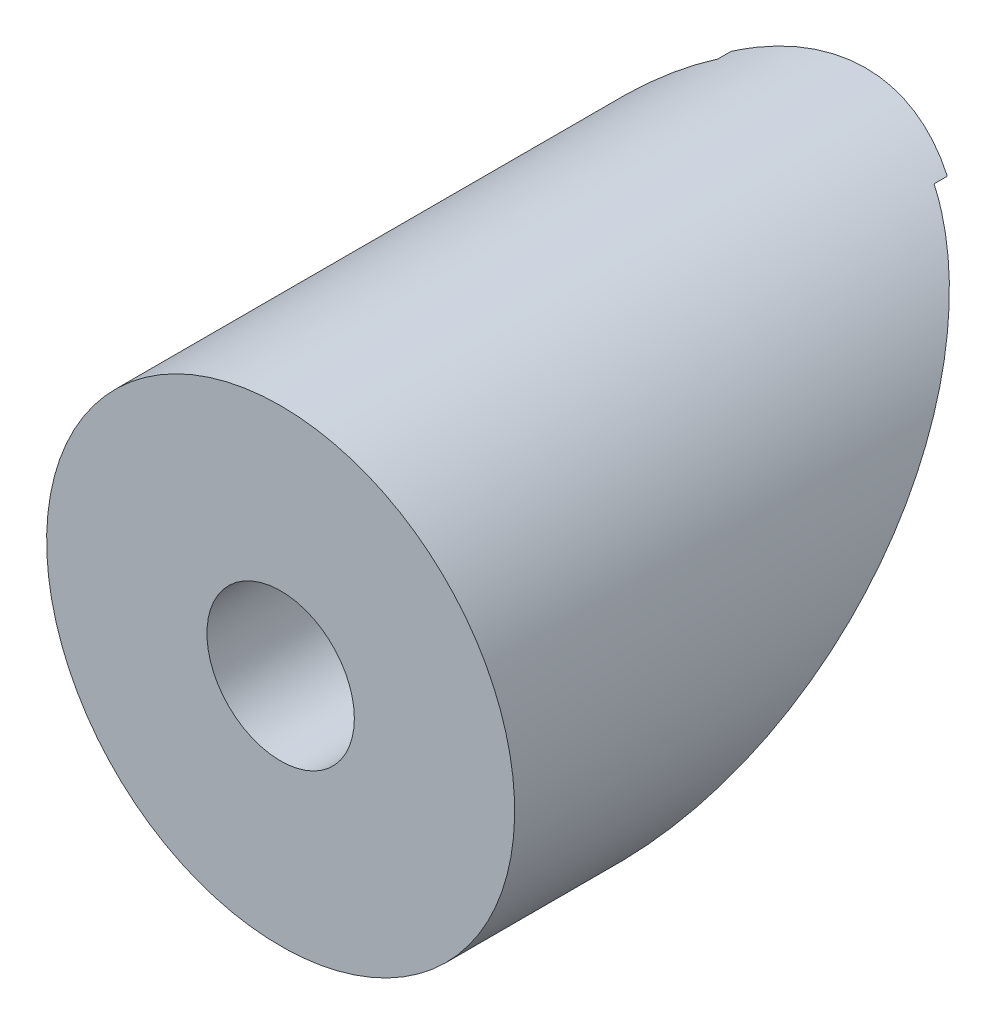
ISO-10303-21;
HEADER;
FILE_DESCRIPTION(('STEP AP214'),'2;1');
FILE_NAME('part.step','',(''),(''),'','','');
FILE_SCHEMA(('AUTOMOTIVE_DESIGN { 1 0 10303 214 1 1 1 1 }'));
ENDSEC;
DATA;
#1=APPLICATION_CONTEXT('core data for automotive mechanical design processes');
#2=APPLICATION_PROTOCOL_DEFINITION('international standard','automotive_design',2000,#1);
#3=PRODUCT_CONTEXT('',#1,'mechanical');
#4=PRODUCT('Part','Part','',(#3));
#5=PRODUCT_RELATED_PRODUCT_CATEGORY('part','',(#4));
#6=PRODUCT_DEFINITION_FORMATION('','',#4);
#7=PRODUCT_DEFINITION_CONTEXT('part definition',#1,'design');
#8=PRODUCT_DEFINITION('design','',#6,#7);
#9=PRODUCT_DEFINITION_SHAPE('','',#8);
#10=(LENGTH_UNIT() NAMED_UNIT(*) SI_UNIT(.MILLI.,.METRE.));
#11=(NAMED_UNIT(*) PLANE_ANGLE_UNIT() SI_UNIT($,.RADIAN.));
#12=(NAMED_UNIT(*) SI_UNIT($,.STERADIAN.) SOLID_ANGLE_UNIT());
#13=UNCERTAINTY_MEASURE_WITH_UNIT(LENGTH_MEASURE(1.E-05),#10,'distance_accuracy_value','');
#14=(GEOMETRIC_REPRESENTATION_CONTEXT(3) GLOBAL_UNCERTAINTY_ASSIGNED_CONTEXT((#13)) GLOBAL_UNIT_ASSIGNED_CONTEXT((#10,
#11,#12)) REPRESENTATION_CONTEXT('',''));
#15=CARTESIAN_POINT('',(0.,0.,0.));
#16=DIRECTION('',(0.,0.,1.));
#17=DIRECTION('',(1.,0.,0.));
#18=AXIS2_PLACEMENT_3D('',#15,#16,#17);
#19=CARTESIAN_POINT('',(9.525,9.525,-19.0500000000002));
#20=DIRECTION('',(0.,0.707106781186551,0.707106781186544));
#21=DIRECTION('',(0.,-0.707106781186544,0.707106781186551));
#22=AXIS2_PLACEMENT_3D('',#19,#20,#21);
#23=PLANE('',#22);
#24=CARTESIAN_POINT('',(0.,0.,-9.5250000000001));
#25=DIRECTION('',(0.,0.707106781186551,0.707106781186544));
#26=DIRECTION('',(0.,0.707106781186544,-0.707106781186551));
#27=AXIS2_PLACEMENT_3D('',#24,#25,#26);
#28=ELLIPSE('',#27,8.9802561210692,6.35);
#29=CARTESIAN_POINT('',(-2.9339073296555,-5.63157951031447,-3.89342048968557));
#30=VERTEX_POINT('',#29);
#31=CARTESIAN_POINT('',(2.9339073296555,-5.63157951031447,-3.89342048968557));
#32=VERTEX_POINT('',#31);
#33=EDGE_CURVE('E138',#30,#32,#28,.T.);
#34=ORIENTED_EDGE('',*,*,#33,.F.);
#35=DIRECTION('',(1.,0.,0.));
#36=VECTOR('',#35,1.);
#37=CARTESIAN_POINT('',(-6.35,-5.63157951031447,-3.89342048968557));
#38=LINE('',#37,#36);
#39=EDGE_CURVE('E108',#30,#32,#38,.T.);
#40=ORIENTED_EDGE('',*,*,#39,.T.);
#41=EDGE_LOOP('',(#34,#40));
#42=FACE_BOUND('',#41,.T.);
#43=ADVANCED_FACE('F64',(#42),#23,.F.);
#44=CARTESIAN_POINT('',(2.93390732965544,5.63157951031453,-15.1565795103146));
#45=VERTEX_POINT('',#44);
#46=CARTESIAN_POINT('',(-2.93390732965544,5.63157951031453,-15.1565795103146));
#47=VERTEX_POINT('',#46);
#48=EDGE_CURVE('E134',#45,#47,#28,.T.);
#49=ORIENTED_EDGE('',*,*,#48,.F.);
#50=DIRECTION('',(1.,0.,0.));
#51=VECTOR('',#50,1.);
#52=CARTESIAN_POINT('',(-6.35,5.63157951031453,-15.1565795103146));
#53=LINE('',#52,#51);
#54=EDGE_CURVE('E130',#47,#45,#53,.T.);
#55=ORIENTED_EDGE('',*,*,#54,.F.);
#56=EDGE_LOOP('',(#49,#55));
#57=FACE_BOUND('',#56,.T.);
#58=ADVANCED_FACE('F147',(#57),#23,.F.);
#59=CARTESIAN_POINT('',(0.,0.,1.20000000008674E-05));
#60=DIRECTION('',(0.,0.,-1.));
#61=DIRECTION('',(-1.,0.,0.));
#62=AXIS2_PLACEMENT_3D('',#59,#60,#61);
#63=CYLINDRICAL_SURFACE('',#62,6.35);
#64=CARTESIAN_POINT('',(0.,0.,-3.89342048968555));
#65=DIRECTION('',(0.,0.,1.));
#66=DIRECTION('',(0.,-1.,0.));
#67=AXIS2_PLACEMENT_3D('',#64,#65,#66);
#68=CIRCLE('',#67,6.35);
#69=CARTESIAN_POINT('',(-3.53901431595145,-5.27236926547171,-3.89342048968556));
#70=VERTEX_POINT('',#69);
#71=EDGE_CURVE('E13',#30,#70,#68,.F.);
#72=ORIENTED_EDGE('',*,*,#71,.F.);
#73=ORIENTED_EDGE('',*,*,#33,.T.);
#74=CARTESIAN_POINT('',(3.53901431595145,-5.27236926547171,-3.89342048968556));
#75=VERTEX_POINT('',#74);
#76=EDGE_CURVE('E74',#75,#32,#68,.F.);
#77=ORIENTED_EDGE('',*,*,#76,.F.);
#78=CARTESIAN_POINT('',(0.,0.,-9.16578975515727));
#79=DIRECTION('',(0.,0.707106781186547,0.707106781186548));
#80=DIRECTION('',(0.,0.707106781186548,-0.707106781186547));
#81=AXIS2_PLACEMENT_3D('',#78,#79,#80);
#82=ELLIPSE('',#81,8.98025612106915,6.35);
#83=CARTESIAN_POINT('',(2.93390732965544,5.63157951031453,-14.7973692654718));
#84=VERTEX_POINT('',#83);
#85=EDGE_CURVE('E115',#84,#75,#82,.F.);
#86=ORIENTED_EDGE('',*,*,#85,.F.);
#87=DIRECTION('',(0.,0.,-1.));
#88=VECTOR('',#87,1.);
#89=CARTESIAN_POINT('',(2.93390732965544,5.6315795103145,1.20000000144656E-05));
#90=LINE('',#89,#88);
#91=EDGE_CURVE('E68',#45,#84,#90,.F.);
#92=ORIENTED_EDGE('',*,*,#91,.F.);
#93=ORIENTED_EDGE('',*,*,#48,.T.);
#94=DIRECTION('',(0.,0.,-1.));
#95=VECTOR('',#94,1.);
#96=CARTESIAN_POINT('',(-2.93390732965544,5.6315795103145,1.20000000144656E-05));
#97=LINE('',#96,#95);
#98=CARTESIAN_POINT('',(-2.93390732965537,5.63157951031453,-14.7973692654718));
#99=VERTEX_POINT('',#98);
#100=EDGE_CURVE('E122',#99,#47,#97,.T.);
#101=ORIENTED_EDGE('',*,*,#100,.F.);
#102=EDGE_CURVE('E81',#70,#99,#82,.F.);
#103=ORIENTED_EDGE('',*,*,#102,.F.);
#104=EDGE_LOOP('',(#72,#73,#77,#86,#92,#93,#101,#103));
#105=FACE_BOUND('',#104,.T.);
#106=CARTESIAN_POINT('',(0.,0.,0.));
#107=DIRECTION('',(0.,0.,-1.));
#108=DIRECTION('',(0.,1.,0.));
#109=AXIS2_PLACEMENT_3D('',#106,#107,#108);
#110=CIRCLE('',#109,6.35);
#111=CARTESIAN_POINT('',(0.,6.35,0.));
#112=VERTEX_POINT('',#111);
#113=EDGE_CURVE('E135',#112,#112,#110,.T.);
#114=ORIENTED_EDGE('',*,*,#113,.T.);
#115=EDGE_LOOP('',(#114));
#116=FACE_BOUND('',#115,.T.);
#117=ADVANCED_FACE('F119',(#105,#116),#63,.T.);
#118=CARTESIAN_POINT('',(9.525,9.525,0.));
#119=DIRECTION('',(0.,0.,-1.));
#120=DIRECTION('',(0.,1.,0.));
#121=AXIS2_PLACEMENT_3D('',#118,#119,#120);
#122=PLANE('',#121);
#123=CARTESIAN_POINT('',(0.,0.,0.));
#124=DIRECTION('',(0.,0.,1.));
#125=DIRECTION('',(1.,0.,0.));
#126=AXIS2_PLACEMENT_3D('',#123,#124,#125);
#127=CIRCLE('',#126,2.);
#128=CARTESIAN_POINT('',(2.,0.,0.));
#129=VERTEX_POINT('',#128);
#130=EDGE_CURVE('E125',#129,#129,#127,.T.);
#131=ORIENTED_EDGE('',*,*,#130,.F.);
#132=EDGE_LOOP('',(#131));
#133=FACE_BOUND('',#132,.T.);
#134=ORIENTED_EDGE('',*,*,#113,.F.);
#135=EDGE_LOOP('',(#134));
#136=FACE_BOUND('',#135,.T.);
#137=ADVANCED_FACE('F66',(#133,#136),#122,.F.);
#138=CARTESIAN_POINT('',(0.,0.,-15.8750000000002));
#139=DIRECTION('',(0.,0.,1.));
#140=DIRECTION('',(1.,0.,0.));
#141=AXIS2_PLACEMENT_3D('',#138,#139,#140);
#142=CYLINDRICAL_SURFACE('',#141,2.);
#143=CARTESIAN_POINT('',(0.,0.,-9.16578975515727));
#144=DIRECTION('',(0.,0.707106781186547,0.707106781186548));
#145=DIRECTION('',(0.,-0.707106781186548,0.707106781186547));
#146=AXIS2_PLACEMENT_3D('',#143,#144,#145);
#147=ELLIPSE('',#146,2.82842712474619,2.);
#148=CARTESIAN_POINT('',(0.,-2.,-7.16578975515727));
#149=VERTEX_POINT('',#148);
#150=EDGE_CURVE('E123',#149,#149,#147,.F.);
#151=ORIENTED_EDGE('',*,*,#150,.T.);
#152=EDGE_LOOP('',(#151));
#153=FACE_BOUND('',#152,.T.);
#154=ORIENTED_EDGE('',*,*,#130,.T.);
#155=EDGE_LOOP('',(#154));
#156=FACE_BOUND('',#155,.T.);
#157=ADVANCED_FACE('F156',(#153,#156),#142,.F.);
#158=CARTESIAN_POINT('',(-6.35,5.63157951031453,-14.7973692654718));
#159=DIRECTION('',(0.,0.707106781186547,0.707106781186548));
#160=DIRECTION('',(0.,-0.707106781186548,0.707106781186547));
#161=AXIS2_PLACEMENT_3D('',#158,#159,#160);
#162=PLANE('',#161);
#163=ORIENTED_EDGE('',*,*,#85,.T.);
#164=DIRECTION('',(1.,0.,0.));
#165=VECTOR('',#164,1.);
#166=CARTESIAN_POINT('',(-6.35,-5.27236926547171,-3.89342048968556));
#167=LINE('',#166,#165);
#168=EDGE_CURVE('E107',#70,#75,#167,.T.);
#169=ORIENTED_EDGE('',*,*,#168,.F.);
#170=ORIENTED_EDGE('',*,*,#102,.T.);
#171=DIRECTION('',(1.,0.,0.));
#172=VECTOR('',#171,1.);
#173=CARTESIAN_POINT('',(-6.35,5.63157951031453,-14.7973692654718));
#174=LINE('',#173,#172);
#175=EDGE_CURVE('E116',#99,#84,#174,.T.);
#176=ORIENTED_EDGE('',*,*,#175,.T.);
#177=EDGE_LOOP('',(#163,#169,#170,#176));
#178=FACE_BOUND('',#177,.T.);
#179=ORIENTED_EDGE('',*,*,#150,.F.);
#180=EDGE_LOOP('',(#179));
#181=FACE_BOUND('',#180,.T.);
#182=ADVANCED_FACE('F112',(#178,#181),#162,.F.);
#183=CARTESIAN_POINT('',(-6.35,-5.27236926547171,-3.89342048968556));
#184=DIRECTION('',(0.,0.,1.));
#185=DIRECTION('',(0.,-1.,0.));
#186=AXIS2_PLACEMENT_3D('',#183,#184,#185);
#187=PLANE('',#186);
#188=ORIENTED_EDGE('',*,*,#71,.T.);
#189=ORIENTED_EDGE('',*,*,#168,.T.);
#190=ORIENTED_EDGE('',*,*,#76,.T.);
#191=ORIENTED_EDGE('',*,*,#39,.F.);
#192=EDGE_LOOP('',(#188,#189,#190,#191));
#193=FACE_BOUND('',#192,.T.);
#194=ADVANCED_FACE('F106',(#193),#187,.F.);
#195=CARTESIAN_POINT('',(-6.35,5.63157951031453,-15.1565795103146));
#196=DIRECTION('',(0.,1.,0.));
#197=DIRECTION('',(0.,0.,1.));
#198=AXIS2_PLACEMENT_3D('',#195,#196,#197);
#199=PLANE('',#198);
#200=ORIENTED_EDGE('',*,*,#91,.T.);
#201=ORIENTED_EDGE('',*,*,#175,.F.);
#202=ORIENTED_EDGE('',*,*,#100,.T.);
#203=ORIENTED_EDGE('',*,*,#54,.T.);
#204=EDGE_LOOP('',(#200,#201,#202,#203));
#205=FACE_BOUND('',#204,.T.);
#206=ADVANCED_FACE('F142',(#205),#199,.F.);
#207=CLOSED_SHELL('',(#43,#58,#117,#137,#157,#182,#194,#206));
#208=MANIFOLD_SOLID_BREP('B2',#207);
#209=ADVANCED_BREP_SHAPE_REPRESENTATION('',(#18,#208),#14);
#210=SHAPE_DEFINITION_REPRESENTATION(#9,#209);
ENDSEC;
END-ISO-10303-21;
